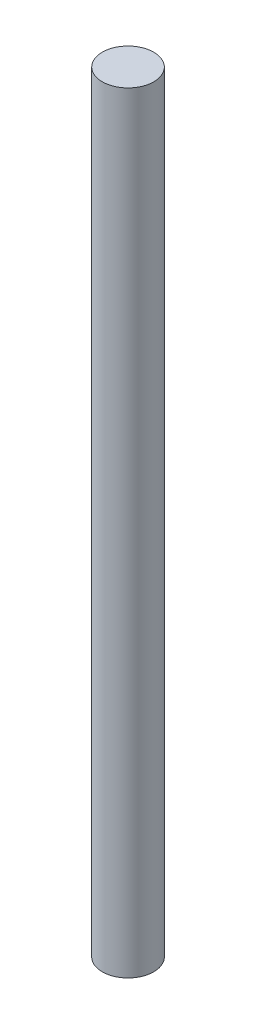
ISO-10303-21;
HEADER;
FILE_DESCRIPTION(('STEP AP214'),'2;1');
FILE_NAME('part.step','',(''),(''),'','','');
FILE_SCHEMA(('AUTOMOTIVE_DESIGN { 1 0 10303 214 1 1 1 1 }'));
ENDSEC;
DATA;
#1=APPLICATION_CONTEXT('core data for automotive mechanical design processes');
#2=APPLICATION_PROTOCOL_DEFINITION('international standard','automotive_design',2000,#1);
#3=PRODUCT_CONTEXT('',#1,'mechanical');
#4=PRODUCT('Part','Part','',(#3));
#5=PRODUCT_RELATED_PRODUCT_CATEGORY('part','',(#4));
#6=PRODUCT_DEFINITION_FORMATION('','',#4);
#7=PRODUCT_DEFINITION_CONTEXT('part definition',#1,'design');
#8=PRODUCT_DEFINITION('design','',#6,#7);
#9=PRODUCT_DEFINITION_SHAPE('','',#8);
#10=(LENGTH_UNIT() NAMED_UNIT(*) SI_UNIT(.MILLI.,.METRE.));
#11=(NAMED_UNIT(*) PLANE_ANGLE_UNIT() SI_UNIT($,.RADIAN.));
#12=(NAMED_UNIT(*) SI_UNIT($,.STERADIAN.) SOLID_ANGLE_UNIT());
#13=UNCERTAINTY_MEASURE_WITH_UNIT(LENGTH_MEASURE(1.E-05),#10,'distance_accuracy_value','');
#14=(GEOMETRIC_REPRESENTATION_CONTEXT(3) GLOBAL_UNCERTAINTY_ASSIGNED_CONTEXT((#13)) GLOBAL_UNIT_ASSIGNED_CONTEXT((#10,
#11,#12)) REPRESENTATION_CONTEXT('',''));
#15=CARTESIAN_POINT('',(0.,0.,0.));
#16=DIRECTION('',(0.,0.,1.));
#17=DIRECTION('',(1.,0.,0.));
#18=AXIS2_PLACEMENT_3D('',#15,#16,#17);
#19=CARTESIAN_POINT('',(-1.27675647831893E-13,676.,0.));
#20=DIRECTION('',(0.,-1.,0.));
#21=DIRECTION('',(-1.,0.,0.));
#22=AXIS2_PLACEMENT_3D('',#19,#20,#21);
#23=CYLINDRICAL_SURFACE('',#22,20.);
#24=CARTESIAN_POINT('',(-1.27675647831893E-13,676.,0.));
#25=DIRECTION('',(0.,-1.,0.));
#26=DIRECTION('',(1.,0.,0.));
#27=AXIS2_PLACEMENT_3D('',#24,#25,#26);
#28=CIRCLE('',#27,20.);
#29=CARTESIAN_POINT('',(19.9999999999999,676.,0.));
#30=VERTEX_POINT('',#29);
#31=EDGE_CURVE('E10',#30,#30,#28,.T.);
#32=ORIENTED_EDGE('',*,*,#31,.T.);
#33=EDGE_LOOP('',(#32));
#34=FACE_BOUND('',#33,.T.);
#35=CARTESIAN_POINT('',(0.,76.,0.));
#36=DIRECTION('',(0.,-1.,0.));
#37=DIRECTION('',(1.,0.,0.));
#38=AXIS2_PLACEMENT_3D('',#35,#36,#37);
#39=CIRCLE('',#38,20.);
#40=CARTESIAN_POINT('',(20.,76.,0.));
#41=VERTEX_POINT('',#40);
#42=EDGE_CURVE('E21',#41,#41,#39,.F.);
#43=ORIENTED_EDGE('',*,*,#42,.T.);
#44=EDGE_LOOP('',(#43));
#45=FACE_BOUND('',#44,.T.);
#46=ADVANCED_FACE('F15',(#34,#45),#23,.T.);
#47=CARTESIAN_POINT('',(-1.27675647831893E-13,676.,0.));
#48=DIRECTION('',(0.,-1.,0.));
#49=DIRECTION('',(-1.,0.,0.));
#50=AXIS2_PLACEMENT_3D('',#47,#48,#49);
#51=PLANE('',#50);
#52=ORIENTED_EDGE('',*,*,#31,.F.);
#53=EDGE_LOOP('',(#52));
#54=FACE_BOUND('',#53,.T.);
#55=ADVANCED_FACE('F33',(#54),#51,.F.);
#56=CARTESIAN_POINT('',(0.,76.,0.));
#57=DIRECTION('',(0.,-1.,0.));
#58=DIRECTION('',(1.,0.,0.));
#59=AXIS2_PLACEMENT_3D('',#56,#57,#58);
#60=PLANE('',#59);
#61=ORIENTED_EDGE('',*,*,#42,.F.);
#62=EDGE_LOOP('',(#61));
#63=FACE_BOUND('',#62,.T.);
#64=ADVANCED_FACE('F31',(#63),#60,.T.);
#65=CLOSED_SHELL('',(#46,#55,#64));
#66=MANIFOLD_SOLID_BREP('B1',#65);
#67=ADVANCED_BREP_SHAPE_REPRESENTATION('',(#18,#66),#14);
#68=SHAPE_DEFINITION_REPRESENTATION(#9,#67);
ENDSEC;
END-ISO-10303-21;
